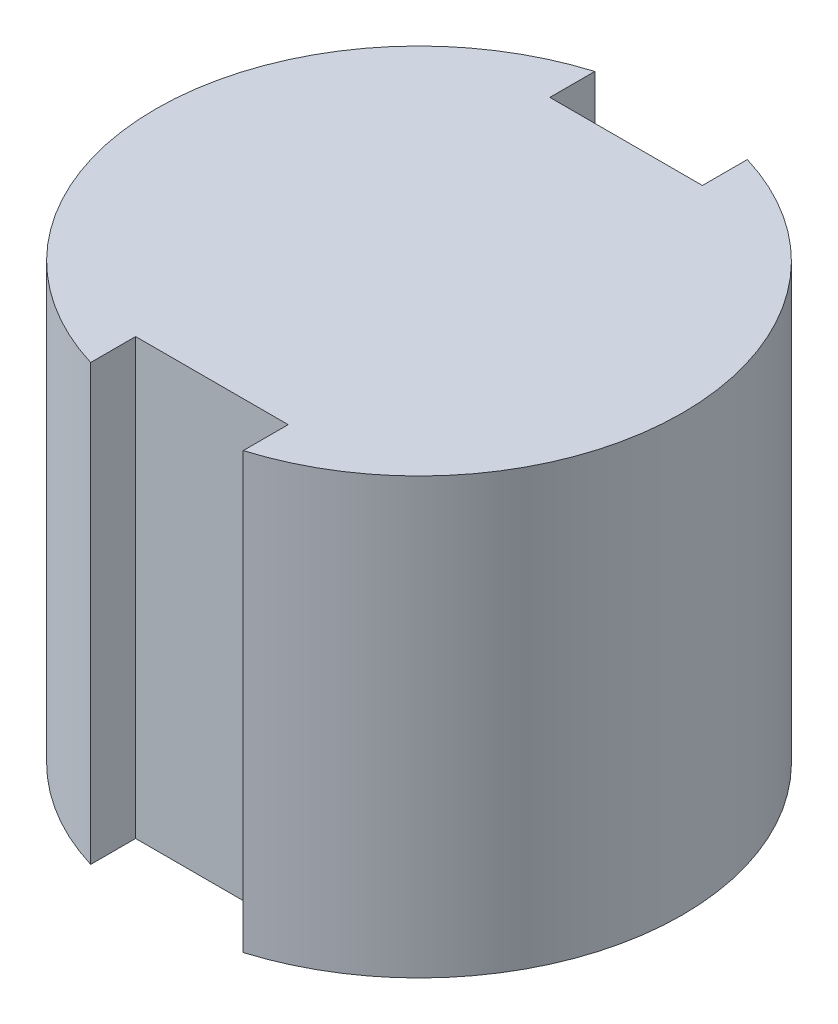
ISO-10303-21;
HEADER;
FILE_DESCRIPTION(('STEP AP214'),'2;1');
FILE_NAME('part.step','',(''),(''),'','','');
FILE_SCHEMA(('AUTOMOTIVE_DESIGN { 1 0 10303 214 1 1 1 1 }'));
ENDSEC;
DATA;
#1=APPLICATION_CONTEXT('core data for automotive mechanical design processes');
#2=APPLICATION_PROTOCOL_DEFINITION('international standard','automotive_design',2000,#1);
#3=PRODUCT_CONTEXT('',#1,'mechanical');
#4=PRODUCT('Part','Part','',(#3));
#5=PRODUCT_RELATED_PRODUCT_CATEGORY('part','',(#4));
#6=PRODUCT_DEFINITION_FORMATION('','',#4);
#7=PRODUCT_DEFINITION_CONTEXT('part definition',#1,'design');
#8=PRODUCT_DEFINITION('design','',#6,#7);
#9=PRODUCT_DEFINITION_SHAPE('','',#8);
#10=(LENGTH_UNIT() NAMED_UNIT(*) SI_UNIT(.MILLI.,.METRE.));
#11=(NAMED_UNIT(*) PLANE_ANGLE_UNIT() SI_UNIT($,.RADIAN.));
#12=(NAMED_UNIT(*) SI_UNIT($,.STERADIAN.) SOLID_ANGLE_UNIT());
#13=UNCERTAINTY_MEASURE_WITH_UNIT(LENGTH_MEASURE(1.E-05),#10,'distance_accuracy_value','');
#14=(GEOMETRIC_REPRESENTATION_CONTEXT(3) GLOBAL_UNCERTAINTY_ASSIGNED_CONTEXT((#13)) GLOBAL_UNIT_ASSIGNED_CONTEXT((#10,
#11,#12)) REPRESENTATION_CONTEXT('',''));
#15=CARTESIAN_POINT('',(0.,0.,0.));
#16=DIRECTION('',(0.,0.,1.));
#17=DIRECTION('',(1.,0.,0.));
#18=AXIS2_PLACEMENT_3D('',#15,#16,#17);
#19=CARTESIAN_POINT('',(0.,0.,0.));
#20=DIRECTION('',(0.,-1.,0.));
#21=DIRECTION('',(-1.,0.,0.));
#22=AXIS2_PLACEMENT_3D('',#19,#20,#21);
#23=CYLINDRICAL_SURFACE('',#22,3.2004);
#24=CARTESIAN_POINT('',(0.,0.,0.));
#25=DIRECTION('',(0.,-1.,0.));
#26=DIRECTION('',(0.,0.,-1.));
#27=AXIS2_PLACEMENT_3D('',#24,#25,#26);
#28=CIRCLE('',#27,3.2004);
#29=CARTESIAN_POINT('',(0.927099999999988,0.,-3.06317576217886));
#30=VERTEX_POINT('',#29);
#31=CARTESIAN_POINT('',(0.9271,0.,3.0631757621789));
#32=VERTEX_POINT('',#31);
#33=EDGE_CURVE('E11',#30,#32,#28,.T.);
#34=ORIENTED_EDGE('',*,*,#33,.F.);
#35=DIRECTION('',(0.,-1.,0.));
#36=VECTOR('',#35,1.);
#37=CARTESIAN_POINT('',(0.9271,5.2832,-3.0631757621789));
#38=LINE('',#37,#36);
#39=CARTESIAN_POINT('',(0.9271,5.2832,-3.0631757621789));
#40=VERTEX_POINT('',#39);
#41=EDGE_CURVE('E25',#40,#30,#38,.T.);
#42=ORIENTED_EDGE('',*,*,#41,.F.);
#43=CARTESIAN_POINT('',(0.,5.2832,0.));
#44=DIRECTION('',(0.,-1.,0.));
#45=DIRECTION('',(0.,0.,-1.));
#46=AXIS2_PLACEMENT_3D('',#43,#44,#45);
#47=CIRCLE('',#46,3.2004);
#48=CARTESIAN_POINT('',(0.9271,5.2832,3.0631757621789));
#49=VERTEX_POINT('',#48);
#50=EDGE_CURVE('E184',#40,#49,#47,.T.);
#51=ORIENTED_EDGE('',*,*,#50,.T.);
#52=DIRECTION('',(0.,-1.,0.));
#53=VECTOR('',#52,1.);
#54=CARTESIAN_POINT('',(0.9271,5.2832,3.0631757621789));
#55=LINE('',#54,#53);
#56=EDGE_CURVE('E180',#49,#32,#55,.T.);
#57=ORIENTED_EDGE('',*,*,#56,.T.);
#58=EDGE_LOOP('',(#34,#42,#51,#57));
#59=FACE_BOUND('',#58,.T.);
#60=ADVANCED_FACE('F17',(#59),#23,.T.);
#61=CARTESIAN_POINT('',(0.9271,5.2832,2.5170757621789));
#62=DIRECTION('',(1.,0.,0.));
#63=DIRECTION('',(0.,0.,-1.));
#64=AXIS2_PLACEMENT_3D('',#61,#62,#63);
#65=PLANE('',#64);
#66=DIRECTION('',(0.,0.,1.));
#67=VECTOR('',#66,1.);
#68=CARTESIAN_POINT('',(0.9271,0.,2.5170757621789));
#69=LINE('',#68,#67);
#70=CARTESIAN_POINT('',(0.9271,0.,2.5170757621789));
#71=VERTEX_POINT('',#70);
#72=EDGE_CURVE('E175',#71,#32,#69,.T.);
#73=ORIENTED_EDGE('',*,*,#72,.T.);
#74=ORIENTED_EDGE('',*,*,#56,.F.);
#75=DIRECTION('',(0.,0.,1.));
#76=VECTOR('',#75,1.);
#77=CARTESIAN_POINT('',(0.9271,5.2832,2.5170757621789));
#78=LINE('',#77,#76);
#79=CARTESIAN_POINT('',(0.9271,5.2832,2.5170757621789));
#80=VERTEX_POINT('',#79);
#81=EDGE_CURVE('E170',#80,#49,#78,.T.);
#82=ORIENTED_EDGE('',*,*,#81,.F.);
#83=DIRECTION('',(0.,-1.,0.));
#84=VECTOR('',#83,1.);
#85=CARTESIAN_POINT('',(0.9271,5.2832,2.5170757621789));
#86=LINE('',#85,#84);
#87=EDGE_CURVE('E166',#80,#71,#86,.T.);
#88=ORIENTED_EDGE('',*,*,#87,.T.);
#89=EDGE_LOOP('',(#73,#74,#82,#88));
#90=FACE_BOUND('',#89,.T.);
#91=ADVANCED_FACE('F197',(#90),#65,.F.);
#92=CARTESIAN_POINT('',(-0.9271,5.2832,2.5170757621789));
#93=DIRECTION('',(0.,0.,-1.));
#94=DIRECTION('',(-1.,0.,0.));
#95=AXIS2_PLACEMENT_3D('',#92,#93,#94);
#96=PLANE('',#95);
#97=DIRECTION('',(1.,0.,0.));
#98=VECTOR('',#97,1.);
#99=CARTESIAN_POINT('',(-0.9271,0.,2.5170757621789));
#100=LINE('',#99,#98);
#101=CARTESIAN_POINT('',(-0.9271,0.,2.5170757621789));
#102=VERTEX_POINT('',#101);
#103=EDGE_CURVE('E161',#102,#71,#100,.T.);
#104=ORIENTED_EDGE('',*,*,#103,.T.);
#105=ORIENTED_EDGE('',*,*,#87,.F.);
#106=DIRECTION('',(1.,0.,0.));
#107=VECTOR('',#106,1.);
#108=CARTESIAN_POINT('',(-0.9271,5.2832,2.5170757621789));
#109=LINE('',#108,#107);
#110=CARTESIAN_POINT('',(-0.9271,5.2832,2.5170757621789));
#111=VERTEX_POINT('',#110);
#112=EDGE_CURVE('E156',#111,#80,#109,.T.);
#113=ORIENTED_EDGE('',*,*,#112,.F.);
#114=DIRECTION('',(0.,-1.,0.));
#115=VECTOR('',#114,1.);
#116=CARTESIAN_POINT('',(-0.9271,5.2832,2.5170757621789));
#117=LINE('',#116,#115);
#118=EDGE_CURVE('E152',#111,#102,#117,.T.);
#119=ORIENTED_EDGE('',*,*,#118,.T.);
#120=EDGE_LOOP('',(#104,#105,#113,#119));
#121=FACE_BOUND('',#120,.T.);
#122=ADVANCED_FACE('F211',(#121),#96,.F.);
#123=CARTESIAN_POINT('',(-0.9271,5.2832,3.0631757621789));
#124=DIRECTION('',(-1.,0.,0.));
#125=DIRECTION('',(0.,0.,1.));
#126=AXIS2_PLACEMENT_3D('',#123,#124,#125);
#127=PLANE('',#126);
#128=DIRECTION('',(0.,0.,-1.));
#129=VECTOR('',#128,1.);
#130=CARTESIAN_POINT('',(-0.9271,0.,3.0631757621789));
#131=LINE('',#130,#129);
#132=CARTESIAN_POINT('',(-0.927099999999988,0.,3.06317576217886));
#133=VERTEX_POINT('',#132);
#134=EDGE_CURVE('E147',#133,#102,#131,.T.);
#135=ORIENTED_EDGE('',*,*,#134,.T.);
#136=ORIENTED_EDGE('',*,*,#118,.F.);
#137=DIRECTION('',(0.,0.,-1.));
#138=VECTOR('',#137,1.);
#139=CARTESIAN_POINT('',(-0.9271,5.2832,3.0631757621789));
#140=LINE('',#139,#138);
#141=CARTESIAN_POINT('',(-0.9271,5.2832,3.0631757621789));
#142=VERTEX_POINT('',#141);
#143=EDGE_CURVE('E142',#142,#111,#140,.T.);
#144=ORIENTED_EDGE('',*,*,#143,.F.);
#145=DIRECTION('',(0.,-1.,0.));
#146=VECTOR('',#145,1.);
#147=CARTESIAN_POINT('',(-0.9271,5.2832,3.0631757621789));
#148=LINE('',#147,#146);
#149=EDGE_CURVE('E138',#142,#133,#148,.T.);
#150=ORIENTED_EDGE('',*,*,#149,.T.);
#151=EDGE_LOOP('',(#135,#136,#144,#150));
#152=FACE_BOUND('',#151,.T.);
#153=ADVANCED_FACE('F209',(#152),#127,.F.);
#154=CARTESIAN_POINT('',(0.,0.,0.));
#155=DIRECTION('',(0.,-1.,0.));
#156=DIRECTION('',(1.,0.,0.));
#157=AXIS2_PLACEMENT_3D('',#154,#155,#156);
#158=CYLINDRICAL_SURFACE('',#157,3.2004);
#159=CARTESIAN_POINT('',(0.,5.2832,0.));
#160=DIRECTION('',(0.,-1.,0.));
#161=DIRECTION('',(0.,0.,-1.));
#162=AXIS2_PLACEMENT_3D('',#159,#160,#161);
#163=CIRCLE('',#162,3.2004);
#164=CARTESIAN_POINT('',(-0.9271,5.2832,-3.0631757621789));
#165=VERTEX_POINT('',#164);
#166=EDGE_CURVE('E134',#142,#165,#163,.T.);
#167=ORIENTED_EDGE('',*,*,#166,.T.);
#168=DIRECTION('',(0.,-1.,0.));
#169=VECTOR('',#168,1.);
#170=CARTESIAN_POINT('',(-0.9271,5.2832,-3.0631757621789));
#171=LINE('',#170,#169);
#172=CARTESIAN_POINT('',(-0.9271,0.,-3.0631757621789));
#173=VERTEX_POINT('',#172);
#174=EDGE_CURVE('E97',#165,#173,#171,.T.);
#175=ORIENTED_EDGE('',*,*,#174,.T.);
#176=CARTESIAN_POINT('',(0.,0.,0.));
#177=DIRECTION('',(0.,-1.,0.));
#178=DIRECTION('',(0.,0.,-1.));
#179=AXIS2_PLACEMENT_3D('',#176,#177,#178);
#180=CIRCLE('',#179,3.2004);
#181=EDGE_CURVE('E126',#133,#173,#180,.T.);
#182=ORIENTED_EDGE('',*,*,#181,.F.);
#183=ORIENTED_EDGE('',*,*,#149,.F.);
#184=EDGE_LOOP('',(#167,#175,#182,#183));
#185=FACE_BOUND('',#184,.T.);
#186=ADVANCED_FACE('F206',(#185),#158,.T.);
#187=CARTESIAN_POINT('',(0.,0.,-3.2004));
#188=DIRECTION('',(0.,1.,0.));
#189=DIRECTION('',(0.,0.,1.));
#190=AXIS2_PLACEMENT_3D('',#187,#188,#189);
#191=PLANE('',#190);
#192=ORIENTED_EDGE('',*,*,#181,.T.);
#193=DIRECTION('',(0.,0.,-1.));
#194=VECTOR('',#193,1.);
#195=CARTESIAN_POINT('',(-0.9271,0.,-2.5170757621789));
#196=LINE('',#195,#194);
#197=CARTESIAN_POINT('',(-0.9271,0.,-2.5170757621789));
#198=VERTEX_POINT('',#197);
#199=EDGE_CURVE('E122',#198,#173,#196,.T.);
#200=ORIENTED_EDGE('',*,*,#199,.F.);
#201=DIRECTION('',(1.,0.,0.));
#202=VECTOR('',#201,1.);
#203=CARTESIAN_POINT('',(0.,0.,-2.5170757621789));
#204=LINE('',#203,#202);
#205=CARTESIAN_POINT('',(0.9271,0.,-2.5170757621789));
#206=VERTEX_POINT('',#205);
#207=EDGE_CURVE('E100',#198,#206,#204,.T.);
#208=ORIENTED_EDGE('',*,*,#207,.T.);
#209=DIRECTION('',(0.,0.,1.));
#210=VECTOR('',#209,1.);
#211=CARTESIAN_POINT('',(0.9271,0.,-3.0631757621789));
#212=LINE('',#211,#210);
#213=EDGE_CURVE('E114',#30,#206,#212,.T.);
#214=ORIENTED_EDGE('',*,*,#213,.F.);
#215=ORIENTED_EDGE('',*,*,#33,.T.);
#216=ORIENTED_EDGE('',*,*,#72,.F.);
#217=ORIENTED_EDGE('',*,*,#103,.F.);
#218=ORIENTED_EDGE('',*,*,#134,.F.);
#219=EDGE_LOOP('',(#192,#200,#208,#214,#215,#216,#217,#218));
#220=FACE_BOUND('',#219,.T.);
#221=ADVANCED_FACE('F201',(#220),#191,.F.);
#222=CARTESIAN_POINT('',(0.9271,5.2832,-3.0631757621789));
#223=DIRECTION('',(1.,0.,0.));
#224=DIRECTION('',(0.,0.,-1.));
#225=AXIS2_PLACEMENT_3D('',#222,#223,#224);
#226=PLANE('',#225);
#227=ORIENTED_EDGE('',*,*,#213,.T.);
#228=DIRECTION('',(0.,-1.,0.));
#229=VECTOR('',#228,1.);
#230=CARTESIAN_POINT('',(0.9271,5.2832,-2.5170757621789));
#231=LINE('',#230,#229);
#232=CARTESIAN_POINT('',(0.9271,5.2832,-2.5170757621789));
#233=VERTEX_POINT('',#232);
#234=EDGE_CURVE('E110',#233,#206,#231,.T.);
#235=ORIENTED_EDGE('',*,*,#234,.F.);
#236=DIRECTION('',(0.,0.,1.));
#237=VECTOR('',#236,1.);
#238=CARTESIAN_POINT('',(0.9271,5.2832,-3.0631757621789));
#239=LINE('',#238,#237);
#240=EDGE_CURVE('E86',#40,#233,#239,.T.);
#241=ORIENTED_EDGE('',*,*,#240,.F.);
#242=ORIENTED_EDGE('',*,*,#41,.T.);
#243=EDGE_LOOP('',(#227,#235,#241,#242));
#244=FACE_BOUND('',#243,.T.);
#245=ADVANCED_FACE('F193',(#244),#226,.F.);
#246=CARTESIAN_POINT('',(0.,5.2832,0.));
#247=DIRECTION('',(0.,-1.,0.));
#248=DIRECTION('',(0.,0.,-1.));
#249=AXIS2_PLACEMENT_3D('',#246,#247,#248);
#250=PLANE('',#249);
#251=DIRECTION('',(-1.,0.,0.));
#252=VECTOR('',#251,1.);
#253=CARTESIAN_POINT('',(0.9271,5.2832,-2.5170757621789));
#254=LINE('',#253,#252);
#255=CARTESIAN_POINT('',(-0.9271,5.2832,-2.5170757621789));
#256=VERTEX_POINT('',#255);
#257=EDGE_CURVE('E79',#233,#256,#254,.T.);
#258=ORIENTED_EDGE('',*,*,#257,.T.);
#259=DIRECTION('',(0.,0.,-1.));
#260=VECTOR('',#259,1.);
#261=CARTESIAN_POINT('',(-0.9271,5.2832,-2.5170757621789));
#262=LINE('',#261,#260);
#263=EDGE_CURVE('E83',#256,#165,#262,.T.);
#264=ORIENTED_EDGE('',*,*,#263,.T.);
#265=ORIENTED_EDGE('',*,*,#166,.F.);
#266=ORIENTED_EDGE('',*,*,#143,.T.);
#267=ORIENTED_EDGE('',*,*,#112,.T.);
#268=ORIENTED_EDGE('',*,*,#81,.T.);
#269=ORIENTED_EDGE('',*,*,#50,.F.);
#270=ORIENTED_EDGE('',*,*,#240,.T.);
#271=EDGE_LOOP('',(#258,#264,#265,#266,#267,#268,#269,#270));
#272=FACE_BOUND('',#271,.T.);
#273=ADVANCED_FACE('F81',(#272),#250,.F.);
#274=CARTESIAN_POINT('',(-0.9271,5.2832,-2.5170757621789));
#275=DIRECTION('',(-1.,0.,0.));
#276=DIRECTION('',(0.,0.,1.));
#277=AXIS2_PLACEMENT_3D('',#274,#275,#276);
#278=PLANE('',#277);
#279=ORIENTED_EDGE('',*,*,#199,.T.);
#280=ORIENTED_EDGE('',*,*,#174,.F.);
#281=ORIENTED_EDGE('',*,*,#263,.F.);
#282=DIRECTION('',(0.,-1.,0.));
#283=VECTOR('',#282,1.);
#284=CARTESIAN_POINT('',(-0.9271,5.2832,-2.5170757621789));
#285=LINE('',#284,#283);
#286=EDGE_CURVE('E95',#256,#198,#285,.T.);
#287=ORIENTED_EDGE('',*,*,#286,.T.);
#288=EDGE_LOOP('',(#279,#280,#281,#287));
#289=FACE_BOUND('',#288,.T.);
#290=ADVANCED_FACE('F94',(#289),#278,.F.);
#291=CARTESIAN_POINT('',(0.9271,5.2832,-2.5170757621789));
#292=DIRECTION('',(0.,0.,1.));
#293=DIRECTION('',(1.,0.,0.));
#294=AXIS2_PLACEMENT_3D('',#291,#292,#293);
#295=PLANE('',#294);
#296=ORIENTED_EDGE('',*,*,#234,.T.);
#297=ORIENTED_EDGE('',*,*,#207,.F.);
#298=ORIENTED_EDGE('',*,*,#286,.F.);
#299=ORIENTED_EDGE('',*,*,#257,.F.);
#300=EDGE_LOOP('',(#296,#297,#298,#299));
#301=FACE_BOUND('',#300,.T.);
#302=ADVANCED_FACE('F99',(#301),#295,.F.);
#303=CLOSED_SHELL('',(#60,#91,#122,#153,#186,#221,#245,#273,#290,#302));
#304=MANIFOLD_SOLID_BREP('B1',#303);
#305=ADVANCED_BREP_SHAPE_REPRESENTATION('',(#18,#304),#14);
#306=SHAPE_DEFINITION_REPRESENTATION(#9,#305);
ENDSEC;
END-ISO-10303-21;
